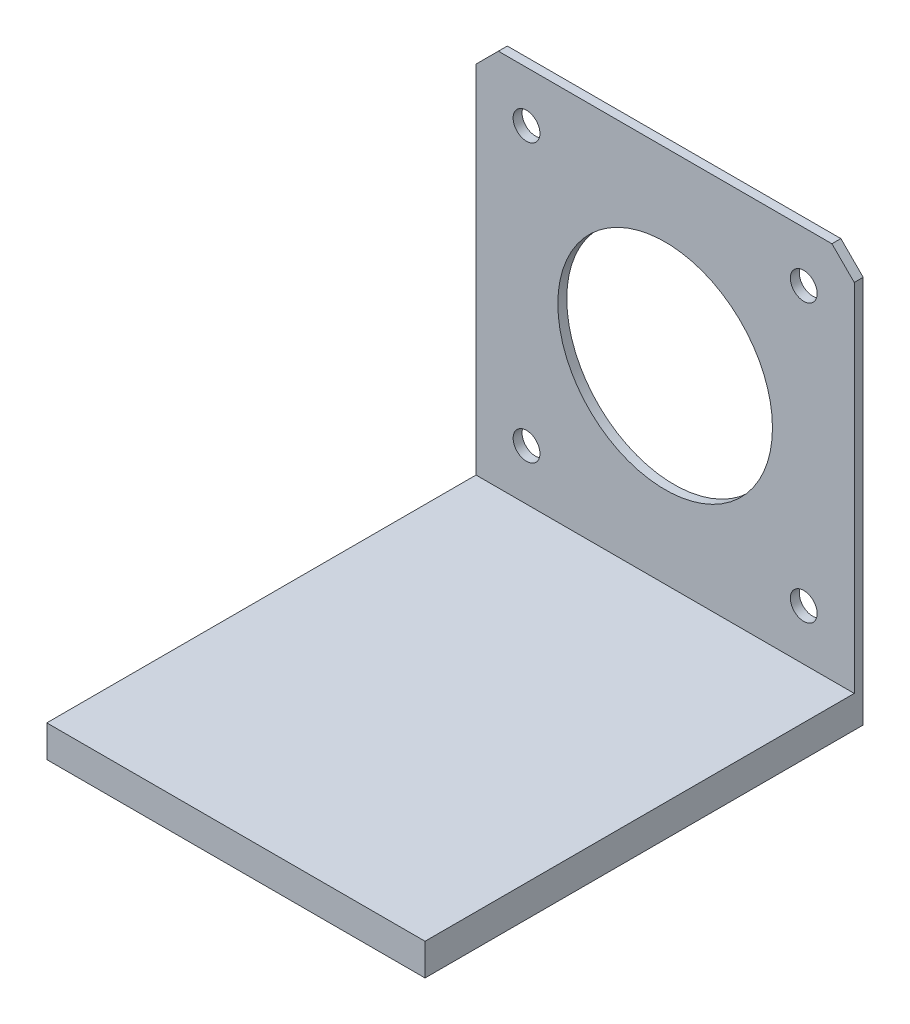
ISO-10303-21;
HEADER;
FILE_DESCRIPTION(('STEP AP214'),'2;1');
FILE_NAME('part.step','',(''),(''),'','','');
FILE_SCHEMA(('AUTOMOTIVE_DESIGN { 1 0 10303 214 1 1 1 1 }'));
ENDSEC;
DATA;
#1=APPLICATION_CONTEXT('core data for automotive mechanical design processes');
#2=APPLICATION_PROTOCOL_DEFINITION('international standard','automotive_design',2000,#1);
#3=PRODUCT_CONTEXT('',#1,'mechanical');
#4=PRODUCT('Part','Part','',(#3));
#5=PRODUCT_RELATED_PRODUCT_CATEGORY('part','',(#4));
#6=PRODUCT_DEFINITION_FORMATION('','',#4);
#7=PRODUCT_DEFINITION_CONTEXT('part definition',#1,'design');
#8=PRODUCT_DEFINITION('design','',#6,#7);
#9=PRODUCT_DEFINITION_SHAPE('','',#8);
#10=(LENGTH_UNIT() NAMED_UNIT(*) SI_UNIT(.MILLI.,.METRE.));
#11=(NAMED_UNIT(*) PLANE_ANGLE_UNIT() SI_UNIT($,.RADIAN.));
#12=(NAMED_UNIT(*) SI_UNIT($,.STERADIAN.) SOLID_ANGLE_UNIT());
#13=UNCERTAINTY_MEASURE_WITH_UNIT(LENGTH_MEASURE(1.E-05),#10,'distance_accuracy_value','');
#14=(GEOMETRIC_REPRESENTATION_CONTEXT(3) GLOBAL_UNCERTAINTY_ASSIGNED_CONTEXT((#13)) GLOBAL_UNIT_ASSIGNED_CONTEXT((#10,
#11,#12)) REPRESENTATION_CONTEXT('',''));
#15=CARTESIAN_POINT('',(0.,0.,0.));
#16=DIRECTION('',(0.,0.,1.));
#17=DIRECTION('',(1.,0.,0.));
#18=AXIS2_PLACEMENT_3D('',#15,#16,#17);
#19=CARTESIAN_POINT('',(15.485498489426,0.,0.));
#20=DIRECTION('',(1.,0.,0.));
#21=DIRECTION('',(0.,0.,-1.));
#22=AXIS2_PLACEMENT_3D('',#19,#20,#21);
#23=PLANE('',#22);
#24=DIRECTION('',(0.,0.,-1.));
#25=VECTOR('',#24,1.);
#26=CARTESIAN_POINT('',(15.485498489426,-28.0326586102719,49.));
#27=LINE('',#26,#25);
#28=CARTESIAN_POINT('',(15.485498489426,-28.0326586102719,21.));
#29=VERTEX_POINT('',#28);
#30=CARTESIAN_POINT('',(15.485498489426,-28.0326586102719,1.));
#31=VERTEX_POINT('',#30);
#32=EDGE_CURVE('E512',#29,#31,#27,.T.);
#33=ORIENTED_EDGE('',*,*,#32,.F.);
#34=DIRECTION('',(0.,-1.,0.));
#35=VECTOR('',#34,1.);
#36=CARTESIAN_POINT('',(15.485498489426,-25.4726586102719,21.));
#37=LINE('',#36,#35);
#38=CARTESIAN_POINT('',(15.485498489426,-25.4726586102719,21.));
#39=VERTEX_POINT('',#38);
#40=EDGE_CURVE('E469',#39,#29,#37,.T.);
#41=ORIENTED_EDGE('',*,*,#40,.F.);
#42=DIRECTION('',(0.,0.,-1.));
#43=VECTOR('',#42,1.);
#44=CARTESIAN_POINT('',(15.485498489426,-25.4726586102719,49.));
#45=LINE('',#44,#43);
#46=CARTESIAN_POINT('',(15.485498489426,-25.4726586102719,1.));
#47=VERTEX_POINT('',#46);
#48=EDGE_CURVE('E217',#39,#47,#45,.T.);
#49=ORIENTED_EDGE('',*,*,#48,.T.);
#50=DIRECTION('',(0.,1.,0.));
#51=VECTOR('',#50,1.);
#52=CARTESIAN_POINT('',(15.485498489426,0.,1.));
#53=LINE('',#52,#51);
#54=EDGE_CURVE('E216',#31,#47,#53,.T.);
#55=ORIENTED_EDGE('',*,*,#54,.F.);
#56=EDGE_LOOP('',(#33,#41,#49,#55));
#57=FACE_BOUND('',#56,.T.);
#58=ADVANCED_FACE('F47',(#57),#23,.F.);
#59=CARTESIAN_POINT('',(-25.814501510574,-25.4726586102719,49.));
#60=DIRECTION('',(0.,1.,0.));
#61=DIRECTION('',(0.,0.,1.));
#62=AXIS2_PLACEMENT_3D('',#59,#60,#61);
#63=PLANE('',#62);
#64=ORIENTED_EDGE('',*,*,#48,.F.);
#65=DIRECTION('',(1.,0.,0.));
#66=VECTOR('',#65,1.);
#67=CARTESIAN_POINT('',(15.485498489426,-25.4726586102719,21.));
#68=LINE('',#67,#66);
#69=CARTESIAN_POINT('',(9.48549848942598,-25.4726586102719,21.));
#70=VERTEX_POINT('',#69);
#71=EDGE_CURVE('E199',#70,#39,#68,.T.);
#72=ORIENTED_EDGE('',*,*,#71,.F.);
#73=DIRECTION('',(0.,0.,-1.));
#74=VECTOR('',#73,1.);
#75=CARTESIAN_POINT('',(9.48549848942598,-25.4726586102719,28.));
#76=LINE('',#75,#74);
#77=CARTESIAN_POINT('',(9.48549848942598,-25.4726586102719,28.));
#78=VERTEX_POINT('',#77);
#79=EDGE_CURVE('E210',#78,#70,#76,.T.);
#80=ORIENTED_EDGE('',*,*,#79,.F.);
#81=DIRECTION('',(-1.,0.,0.));
#82=VECTOR('',#81,1.);
#83=CARTESIAN_POINT('',(15.485498489426,-25.4726586102719,28.));
#84=LINE('',#83,#82);
#85=CARTESIAN_POINT('',(15.485498489426,-25.4726586102719,28.));
#86=VERTEX_POINT('',#85);
#87=EDGE_CURVE('E190',#86,#78,#84,.T.);
#88=ORIENTED_EDGE('',*,*,#87,.F.);
#89=CARTESIAN_POINT('',(15.485498489426,-25.4726586102719,48.));
#90=VERTEX_POINT('',#89);
#91=EDGE_CURVE('E206',#90,#86,#45,.T.);
#92=ORIENTED_EDGE('',*,*,#91,.F.);
#93=DIRECTION('',(1.,0.,0.));
#94=VECTOR('',#93,1.);
#95=CARTESIAN_POINT('',(-25.814501510574,-25.4726586102719,48.));
#96=LINE('',#95,#94);
#97=CARTESIAN_POINT('',(-24.814501510574,-25.4726586102719,48.));
#98=VERTEX_POINT('',#97);
#99=EDGE_CURVE('E244',#98,#90,#96,.T.);
#100=ORIENTED_EDGE('',*,*,#99,.F.);
#101=DIRECTION('',(0.,0.,-1.));
#102=VECTOR('',#101,1.);
#103=CARTESIAN_POINT('',(-24.814501510574,-25.4726586102719,49.));
#104=LINE('',#103,#102);
#105=CARTESIAN_POINT('',(-24.814501510574,-25.4726586102719,28.));
#106=VERTEX_POINT('',#105);
#107=EDGE_CURVE('E236',#98,#106,#104,.T.);
#108=ORIENTED_EDGE('',*,*,#107,.T.);
#109=DIRECTION('',(-1.,0.,0.));
#110=VECTOR('',#109,1.);
#111=CARTESIAN_POINT('',(-24.814501510574,-25.4726586102719,28.));
#112=LINE('',#111,#110);
#113=CARTESIAN_POINT('',(-18.814501510574,-25.4726586102719,28.));
#114=VERTEX_POINT('',#113);
#115=EDGE_CURVE('E488',#114,#106,#112,.T.);
#116=ORIENTED_EDGE('',*,*,#115,.F.);
#117=DIRECTION('',(0.,0.,1.));
#118=VECTOR('',#117,1.);
#119=CARTESIAN_POINT('',(-18.814501510574,-25.4726586102719,28.));
#120=LINE('',#119,#118);
#121=CARTESIAN_POINT('',(-18.814501510574,-25.4726586102719,21.));
#122=VERTEX_POINT('',#121);
#123=EDGE_CURVE('E496',#122,#114,#120,.T.);
#124=ORIENTED_EDGE('',*,*,#123,.F.);
#125=DIRECTION('',(1.,0.,0.));
#126=VECTOR('',#125,1.);
#127=CARTESIAN_POINT('',(-24.814501510574,-25.4726586102719,21.));
#128=LINE('',#127,#126);
#129=CARTESIAN_POINT('',(-24.814501510574,-25.4726586102719,21.));
#130=VERTEX_POINT('',#129);
#131=EDGE_CURVE('E479',#130,#122,#128,.T.);
#132=ORIENTED_EDGE('',*,*,#131,.F.);
#133=CARTESIAN_POINT('',(-24.814501510574,-25.4726586102719,1.));
#134=VERTEX_POINT('',#133);
#135=EDGE_CURVE('E235',#130,#134,#104,.T.);
#136=ORIENTED_EDGE('',*,*,#135,.T.);
#137=DIRECTION('',(1.,0.,0.));
#138=VECTOR('',#137,1.);
#139=CARTESIAN_POINT('',(-25.814501510574,-25.4726586102719,1.));
#140=LINE('',#139,#138);
#141=EDGE_CURVE('E252',#134,#47,#140,.T.);
#142=ORIENTED_EDGE('',*,*,#141,.T.);
#143=EDGE_LOOP('',(#64,#72,#80,#88,#92,#100,#108,#116,#124,#132,#136,#142));
#144=FACE_BOUND('',#143,.T.);
#145=ADVANCED_FACE('F204',(#144),#63,.F.);
#146=CARTESIAN_POINT('',(-24.814501510574,0.,0.));
#147=DIRECTION('',(1.,0.,0.));
#148=DIRECTION('',(0.,0.,-1.));
#149=AXIS2_PLACEMENT_3D('',#146,#147,#148);
#150=PLANE('',#149);
#151=ORIENTED_EDGE('',*,*,#135,.F.);
#152=DIRECTION('',(0.,1.,0.));
#153=VECTOR('',#152,1.);
#154=CARTESIAN_POINT('',(-24.814501510574,-28.0326586102719,21.));
#155=LINE('',#154,#153);
#156=CARTESIAN_POINT('',(-24.814501510574,-28.0326586102719,21.));
#157=VERTEX_POINT('',#156);
#158=EDGE_CURVE('E510',#157,#130,#155,.T.);
#159=ORIENTED_EDGE('',*,*,#158,.F.);
#160=DIRECTION('',(0.,0.,1.));
#161=VECTOR('',#160,1.);
#162=CARTESIAN_POINT('',(-24.814501510574,-28.0326586102719,0.));
#163=LINE('',#162,#161);
#164=CARTESIAN_POINT('',(-24.814501510574,-28.0326586102719,1.));
#165=VERTEX_POINT('',#164);
#166=EDGE_CURVE('E228',#165,#157,#163,.T.);
#167=ORIENTED_EDGE('',*,*,#166,.F.);
#168=DIRECTION('',(0.,1.,0.));
#169=VECTOR('',#168,1.);
#170=CARTESIAN_POINT('',(-24.814501510574,0.,1.));
#171=LINE('',#170,#169);
#172=EDGE_CURVE('E240',#165,#134,#171,.T.);
#173=ORIENTED_EDGE('',*,*,#172,.T.);
#174=EDGE_LOOP('',(#151,#159,#167,#173));
#175=FACE_BOUND('',#174,.T.);
#176=ADVANCED_FACE('F436',(#175),#150,.T.);
#177=CARTESIAN_POINT('',(-24.814501510574,-28.0326586102719,28.));
#178=VERTEX_POINT('',#177);
#179=CARTESIAN_POINT('',(-24.814501510574,-28.0326586102719,48.));
#180=VERTEX_POINT('',#179);
#181=EDGE_CURVE('E222',#178,#180,#163,.T.);
#182=ORIENTED_EDGE('',*,*,#181,.F.);
#183=DIRECTION('',(0.,1.,0.));
#184=VECTOR('',#183,1.);
#185=CARTESIAN_POINT('',(-24.814501510574,-28.0326586102719,28.));
#186=LINE('',#185,#184);
#187=EDGE_CURVE('E72',#178,#106,#186,.T.);
#188=ORIENTED_EDGE('',*,*,#187,.T.);
#189=ORIENTED_EDGE('',*,*,#107,.F.);
#190=DIRECTION('',(0.,1.,0.));
#191=VECTOR('',#190,1.);
#192=CARTESIAN_POINT('',(-24.814501510574,-28.0326586102719,48.));
#193=LINE('',#192,#191);
#194=EDGE_CURVE('E232',#180,#98,#193,.T.);
#195=ORIENTED_EDGE('',*,*,#194,.F.);
#196=EDGE_LOOP('',(#182,#188,#189,#195));
#197=FACE_BOUND('',#196,.T.);
#198=ADVANCED_FACE('F526',(#197),#150,.T.);
#199=CARTESIAN_POINT('',(16.485498489426,17.8273413897281,1.));
#200=DIRECTION('',(-1.,0.,0.));
#201=DIRECTION('',(0.,-1.,0.));
#202=AXIS2_PLACEMENT_3D('',#199,#200,#201);
#203=PLANE('',#202);
#204=DIRECTION('',(0.,1.,0.));
#205=VECTOR('',#204,1.);
#206=CARTESIAN_POINT('',(16.485498489426,17.8273413897281,1.));
#207=LINE('',#206,#205);
#208=CARTESIAN_POINT('',(16.485498489426,-24.4726586102719,1.));
#209=VERTEX_POINT('',#208);
#210=CARTESIAN_POINT('',(16.485498489426,15.3273413897281,1.));
#211=VERTEX_POINT('',#210);
#212=EDGE_CURVE('E335',#209,#211,#207,.T.);
#213=ORIENTED_EDGE('',*,*,#212,.F.);
#214=DIRECTION('',(0.,0.,-1.));
#215=VECTOR('',#214,1.);
#216=CARTESIAN_POINT('',(16.485498489426,-24.4726586102719,49.));
#217=LINE('',#216,#215);
#218=CARTESIAN_POINT('',(16.485498489426,-24.4726586102719,49.));
#219=VERTEX_POINT('',#218);
#220=EDGE_CURVE('E275',#219,#209,#217,.T.);
#221=ORIENTED_EDGE('',*,*,#220,.F.);
#222=DIRECTION('',(0.,1.,0.));
#223=VECTOR('',#222,1.);
#224=CARTESIAN_POINT('',(16.485498489426,-25.4726586102719,49.));
#225=LINE('',#224,#223);
#226=CARTESIAN_POINT('',(16.485498489426,-28.0326586102719,49.));
#227=VERTEX_POINT('',#226);
#228=EDGE_CURVE('E259',#227,#219,#225,.T.);
#229=ORIENTED_EDGE('',*,*,#228,.F.);
#230=DIRECTION('',(0.,0.,1.));
#231=VECTOR('',#230,1.);
#232=CARTESIAN_POINT('',(16.485498489426,-28.0326586102719,1.));
#233=LINE('',#232,#231);
#234=CARTESIAN_POINT('',(16.485498489426,-28.0326586102719,0.));
#235=VERTEX_POINT('',#234);
#236=EDGE_CURVE('E284',#235,#227,#233,.T.);
#237=ORIENTED_EDGE('',*,*,#236,.F.);
#238=DIRECTION('',(0.,1.,0.));
#239=VECTOR('',#238,1.);
#240=CARTESIAN_POINT('',(16.485498489426,17.8273413897281,0.));
#241=LINE('',#240,#239);
#242=CARTESIAN_POINT('',(16.485498489426,15.3273413897281,0.));
#243=VERTEX_POINT('',#242);
#244=EDGE_CURVE('E347',#235,#243,#241,.T.);
#245=ORIENTED_EDGE('',*,*,#244,.T.);
#246=DIRECTION('',(0.,0.,1.));
#247=VECTOR('',#246,1.);
#248=CARTESIAN_POINT('',(16.485498489426,15.3273413897281,1.));
#249=LINE('',#248,#247);
#250=EDGE_CURVE('E369',#243,#211,#249,.T.);
#251=ORIENTED_EDGE('',*,*,#250,.T.);
#252=EDGE_LOOP('',(#213,#221,#229,#237,#245,#251));
#253=FACE_BOUND('',#252,.T.);
#254=ADVANCED_FACE('F408',(#253),#203,.F.);
#255=CARTESIAN_POINT('',(-25.814501510574,17.8273413897281,1.));
#256=DIRECTION('',(1.,0.,0.));
#257=DIRECTION('',(0.,1.,0.));
#258=AXIS2_PLACEMENT_3D('',#255,#256,#257);
#259=PLANE('',#258);
#260=DIRECTION('',(0.,0.,-1.));
#261=VECTOR('',#260,1.);
#262=CARTESIAN_POINT('',(-25.814501510574,-24.4726586102719,49.));
#263=LINE('',#262,#261);
#264=CARTESIAN_POINT('',(-25.814501510574,-24.4726586102719,49.));
#265=VERTEX_POINT('',#264);
#266=CARTESIAN_POINT('',(-25.814501510574,-24.4726586102719,1.));
#267=VERTEX_POINT('',#266);
#268=EDGE_CURVE('E266',#265,#267,#263,.T.);
#269=ORIENTED_EDGE('',*,*,#268,.T.);
#270=DIRECTION('',(0.,-1.,0.));
#271=VECTOR('',#270,1.);
#272=CARTESIAN_POINT('',(-25.814501510574,17.8273413897281,1.));
#273=LINE('',#272,#271);
#274=CARTESIAN_POINT('',(-25.814501510574,15.3273413897281,1.));
#275=VERTEX_POINT('',#274);
#276=EDGE_CURVE('E331',#275,#267,#273,.T.);
#277=ORIENTED_EDGE('',*,*,#276,.F.);
#278=DIRECTION('',(0.,0.,-1.));
#279=VECTOR('',#278,1.);
#280=CARTESIAN_POINT('',(-25.814501510574,15.3273413897281,1.));
#281=LINE('',#280,#279);
#282=CARTESIAN_POINT('',(-25.814501510574,15.3273413897281,0.));
#283=VERTEX_POINT('',#282);
#284=EDGE_CURVE('E359',#275,#283,#281,.T.);
#285=ORIENTED_EDGE('',*,*,#284,.T.);
#286=DIRECTION('',(0.,-1.,0.));
#287=VECTOR('',#286,1.);
#288=CARTESIAN_POINT('',(-25.814501510574,17.8273413897281,0.));
#289=LINE('',#288,#287);
#290=CARTESIAN_POINT('',(-25.814501510574,-28.0326586102719,0.));
#291=VERTEX_POINT('',#290);
#292=EDGE_CURVE('E327',#283,#291,#289,.T.);
#293=ORIENTED_EDGE('',*,*,#292,.T.);
#294=DIRECTION('',(0.,0.,-1.));
#295=VECTOR('',#294,1.);
#296=CARTESIAN_POINT('',(-25.814501510574,-28.0326586102719,1.));
#297=LINE('',#296,#295);
#298=CARTESIAN_POINT('',(-25.814501510574,-28.0326586102719,49.));
#299=VERTEX_POINT('',#298);
#300=EDGE_CURVE('E278',#299,#291,#297,.T.);
#301=ORIENTED_EDGE('',*,*,#300,.F.);
#302=DIRECTION('',(0.,-1.,0.));
#303=VECTOR('',#302,1.);
#304=CARTESIAN_POINT('',(-25.814501510574,-25.4726586102719,49.));
#305=LINE('',#304,#303);
#306=EDGE_CURVE('E255',#265,#299,#305,.T.);
#307=ORIENTED_EDGE('',*,*,#306,.F.);
#308=EDGE_LOOP('',(#269,#277,#285,#293,#301,#307));
#309=FACE_BOUND('',#308,.T.);
#310=ADVANCED_FACE('F397',(#309),#259,.F.);
#311=CARTESIAN_POINT('',(0.,0.,1.));
#312=DIRECTION('',(0.,0.,1.));
#313=DIRECTION('',(1.,0.,0.));
#314=AXIS2_PLACEMENT_3D('',#311,#312,#313);
#315=PLANE('',#314);
#316=DIRECTION('',(-1.,0.,0.));
#317=VECTOR('',#316,1.);
#318=CARTESIAN_POINT('',(-25.814501510574,-28.0326586102719,1.));
#319=LINE('',#318,#317);
#320=EDGE_CURVE('E287',#31,#165,#319,.T.);
#321=ORIENTED_EDGE('',*,*,#320,.F.);
#322=ORIENTED_EDGE('',*,*,#54,.T.);
#323=ORIENTED_EDGE('',*,*,#141,.F.);
#324=ORIENTED_EDGE('',*,*,#172,.F.);
#325=EDGE_LOOP('',(#321,#322,#323,#324));
#326=FACE_BOUND('',#325,.T.);
#327=ADVANCED_FACE('F536',(#326),#315,.T.);
#328=CARTESIAN_POINT('',(-25.814501510574,-28.0326586102719,48.));
#329=DIRECTION('',(0.,0.,1.));
#330=DIRECTION('',(1.,0.,0.));
#331=AXIS2_PLACEMENT_3D('',#328,#329,#330);
#332=PLANE('',#331);
#333=DIRECTION('',(0.,1.,0.));
#334=VECTOR('',#333,1.);
#335=CARTESIAN_POINT('',(15.485498489426,-28.0326586102719,48.));
#336=LINE('',#335,#334);
#337=CARTESIAN_POINT('',(15.485498489426,-28.0326586102719,48.));
#338=VERTEX_POINT('',#337);
#339=EDGE_CURVE('E11',#338,#90,#336,.T.);
#340=ORIENTED_EDGE('',*,*,#339,.F.);
#341=DIRECTION('',(1.,0.,0.));
#342=VECTOR('',#341,1.);
#343=CARTESIAN_POINT('',(-25.814501510574,-28.0326586102719,48.));
#344=LINE('',#343,#342);
#345=EDGE_CURVE('E245',#180,#338,#344,.T.);
#346=ORIENTED_EDGE('',*,*,#345,.F.);
#347=ORIENTED_EDGE('',*,*,#194,.T.);
#348=ORIENTED_EDGE('',*,*,#99,.T.);
#349=EDGE_LOOP('',(#340,#346,#347,#348));
#350=FACE_BOUND('',#349,.T.);
#351=ADVANCED_FACE('F520',(#350),#332,.F.);
#352=DIRECTION('',(-1.,0.,0.));
#353=VECTOR('',#352,1.);
#354=CARTESIAN_POINT('',(-25.814501510574,-24.4726586102719,1.));
#355=LINE('',#354,#353);
#356=EDGE_CURVE('E260',#209,#267,#355,.T.);
#357=ORIENTED_EDGE('',*,*,#356,.F.);
#358=ORIENTED_EDGE('',*,*,#212,.T.);
#359=DIRECTION('',(0.707106781186547,-0.707106781186549,0.));
#360=VECTOR('',#359,1.);
#361=CARTESIAN_POINT('',(15.9064199395771,15.906419939577,1.));
#362=LINE('',#361,#360);
#363=CARTESIAN_POINT('',(13.985498489426,17.8273413897281,1.));
#364=VERTEX_POINT('',#363);
#365=EDGE_CURVE('E366',#211,#364,#362,.F.);
#366=ORIENTED_EDGE('',*,*,#365,.T.);
#367=DIRECTION('',(-1.,0.,0.));
#368=VECTOR('',#367,1.);
#369=CARTESIAN_POINT('',(-25.814501510574,17.8273413897281,1.));
#370=LINE('',#369,#368);
#371=CARTESIAN_POINT('',(-23.314501510574,17.8273413897281,1.));
#372=VERTEX_POINT('',#371);
#373=EDGE_CURVE('E339',#364,#372,#370,.T.);
#374=ORIENTED_EDGE('',*,*,#373,.T.);
#375=DIRECTION('',(0.707106781186549,0.707106781186547,0.));
#376=VECTOR('',#375,1.);
#377=CARTESIAN_POINT('',(-20.570921450151,20.5709214501511,1.));
#378=LINE('',#377,#376);
#379=EDGE_CURVE('E363',#372,#275,#378,.F.);
#380=ORIENTED_EDGE('',*,*,#379,.T.);
#381=ORIENTED_EDGE('',*,*,#276,.T.);
#382=EDGE_LOOP('',(#357,#358,#366,#374,#380,#381));
#383=FACE_BOUND('',#382,.T.);
#384=CARTESIAN_POINT('',(10.835498489426,12.1773413897281,1.));
#385=DIRECTION('',(0.,0.,1.));
#386=DIRECTION('',(1.,0.,0.));
#387=AXIS2_PLACEMENT_3D('',#384,#385,#386);
#388=CIRCLE('',#387,1.5);
#389=CARTESIAN_POINT('',(12.335498489426,12.1773413897281,1.));
#390=VERTEX_POINT('',#389);
#391=EDGE_CURVE('E308',#390,#390,#388,.T.);
#392=ORIENTED_EDGE('',*,*,#391,.F.);
#393=EDGE_LOOP('',(#392));
#394=FACE_BOUND('',#393,.T.);
#395=CARTESIAN_POINT('',(10.835498489426,-18.8226586102719,1.));
#396=DIRECTION('',(0.,0.,1.));
#397=DIRECTION('',(1.,0.,0.));
#398=AXIS2_PLACEMENT_3D('',#395,#396,#397);
#399=CIRCLE('',#398,1.5);
#400=CARTESIAN_POINT('',(12.335498489426,-18.8226586102719,1.));
#401=VERTEX_POINT('',#400);
#402=EDGE_CURVE('E300',#401,#401,#399,.T.);
#403=ORIENTED_EDGE('',*,*,#402,.F.);
#404=EDGE_LOOP('',(#403));
#405=FACE_BOUND('',#404,.T.);
#406=CARTESIAN_POINT('',(-20.164501510574,-18.8226586102719,1.));
#407=DIRECTION('',(0.,0.,1.));
#408=DIRECTION('',(1.,0.,0.));
#409=AXIS2_PLACEMENT_3D('',#406,#407,#408);
#410=CIRCLE('',#409,1.5);
#411=CARTESIAN_POINT('',(-18.664501510574,-18.8226586102719,1.));
#412=VERTEX_POINT('',#411);
#413=EDGE_CURVE('E291',#412,#412,#410,.T.);
#414=ORIENTED_EDGE('',*,*,#413,.F.);
#415=EDGE_LOOP('',(#414));
#416=FACE_BOUND('',#415,.T.);
#417=CARTESIAN_POINT('',(-20.164501510574,12.1773413897281,1.));
#418=DIRECTION('',(0.,0.,1.));
#419=DIRECTION('',(1.,0.,0.));
#420=AXIS2_PLACEMENT_3D('',#417,#418,#419);
#421=CIRCLE('',#420,1.5);
#422=CARTESIAN_POINT('',(-18.664501510574,12.1773413897281,1.));
#423=VERTEX_POINT('',#422);
#424=EDGE_CURVE('E295',#423,#423,#421,.T.);
#425=ORIENTED_EDGE('',*,*,#424,.F.);
#426=EDGE_LOOP('',(#425));
#427=FACE_BOUND('',#426,.T.);
#428=CARTESIAN_POINT('',(-4.66450151057403,-3.32265861027189,1.));
#429=DIRECTION('',(0.,0.,1.));
#430=DIRECTION('',(1.,0.,0.));
#431=AXIS2_PLACEMENT_3D('',#428,#429,#430);
#432=CIRCLE('',#431,12.);
#433=CARTESIAN_POINT('',(7.33549848942598,-3.32265861027189,1.));
#434=VERTEX_POINT('',#433);
#435=EDGE_CURVE('E319',#434,#434,#432,.T.);
#436=ORIENTED_EDGE('',*,*,#435,.F.);
#437=EDGE_LOOP('',(#436));
#438=FACE_BOUND('',#437,.T.);
#439=ADVANCED_FACE('F403',(#383,#394,#405,#416,#427,#438),#315,.T.);
#440=CARTESIAN_POINT('',(-25.814501510574,17.8273413897281,1.));
#441=DIRECTION('',(0.,-1.,0.));
#442=DIRECTION('',(0.,0.,-1.));
#443=AXIS2_PLACEMENT_3D('',#440,#441,#442);
#444=PLANE('',#443);
#445=ORIENTED_EDGE('',*,*,#373,.F.);
#446=DIRECTION('',(0.,0.,-1.));
#447=VECTOR('',#446,1.);
#448=CARTESIAN_POINT('',(13.985498489426,17.8273413897281,1.));
#449=LINE('',#448,#447);
#450=CARTESIAN_POINT('',(13.985498489426,17.8273413897281,0.));
#451=VERTEX_POINT('',#450);
#452=EDGE_CURVE('E57',#364,#451,#449,.T.);
#453=ORIENTED_EDGE('',*,*,#452,.T.);
#454=DIRECTION('',(-1.,0.,0.));
#455=VECTOR('',#454,1.);
#456=CARTESIAN_POINT('',(-25.814501510574,17.8273413897281,0.));
#457=LINE('',#456,#455);
#458=CARTESIAN_POINT('',(-23.314501510574,17.8273413897281,0.));
#459=VERTEX_POINT('',#458);
#460=EDGE_CURVE('E336',#451,#459,#457,.T.);
#461=ORIENTED_EDGE('',*,*,#460,.T.);
#462=DIRECTION('',(0.,0.,1.));
#463=VECTOR('',#462,1.);
#464=CARTESIAN_POINT('',(-23.314501510574,17.8273413897281,1.));
#465=LINE('',#464,#463);
#466=EDGE_CURVE('E373',#459,#372,#465,.T.);
#467=ORIENTED_EDGE('',*,*,#466,.T.);
#468=EDGE_LOOP('',(#445,#453,#461,#467));
#469=FACE_BOUND('',#468,.T.);
#470=ADVANCED_FACE('F381',(#469),#444,.F.);
#471=CARTESIAN_POINT('',(0.,0.,0.));
#472=DIRECTION('',(0.,0.,1.));
#473=DIRECTION('',(1.,0.,0.));
#474=AXIS2_PLACEMENT_3D('',#471,#472,#473);
#475=PLANE('',#474);
#476=DIRECTION('',(-0.707106781186547,0.707106781186549,0.));
#477=VECTOR('',#476,1.);
#478=CARTESIAN_POINT('',(13.985498489426,17.8273413897281,0.));
#479=LINE('',#478,#477);
#480=EDGE_CURVE('E355',#451,#243,#479,.F.);
#481=ORIENTED_EDGE('',*,*,#480,.T.);
#482=ORIENTED_EDGE('',*,*,#244,.F.);
#483=DIRECTION('',(1.,0.,0.));
#484=VECTOR('',#483,1.);
#485=CARTESIAN_POINT('',(-25.814501510574,-28.0326586102719,0.));
#486=LINE('',#485,#484);
#487=EDGE_CURVE('E281',#291,#235,#486,.T.);
#488=ORIENTED_EDGE('',*,*,#487,.F.);
#489=ORIENTED_EDGE('',*,*,#292,.F.);
#490=DIRECTION('',(-0.707106781186549,-0.707106781186547,0.));
#491=VECTOR('',#490,1.);
#492=CARTESIAN_POINT('',(-25.814501510574,15.3273413897281,0.));
#493=LINE('',#492,#491);
#494=EDGE_CURVE('E343',#283,#459,#493,.F.);
#495=ORIENTED_EDGE('',*,*,#494,.T.);
#496=ORIENTED_EDGE('',*,*,#460,.F.);
#497=EDGE_LOOP('',(#481,#482,#488,#489,#495,#496));
#498=FACE_BOUND('',#497,.T.);
#499=CARTESIAN_POINT('',(10.835498489426,12.1773413897281,0.));
#500=DIRECTION('',(0.,0.,1.));
#501=DIRECTION('',(1.,0.,0.));
#502=AXIS2_PLACEMENT_3D('',#499,#500,#501);
#503=CIRCLE('',#502,1.5);
#504=CARTESIAN_POINT('',(12.335498489426,12.1773413897281,0.));
#505=VERTEX_POINT('',#504);
#506=EDGE_CURVE('E290',#505,#505,#503,.T.);
#507=ORIENTED_EDGE('',*,*,#506,.T.);
#508=EDGE_LOOP('',(#507));
#509=FACE_BOUND('',#508,.T.);
#510=CARTESIAN_POINT('',(10.835498489426,-18.8226586102719,0.));
#511=DIRECTION('',(0.,0.,1.));
#512=DIRECTION('',(1.,0.,0.));
#513=AXIS2_PLACEMENT_3D('',#510,#511,#512);
#514=CIRCLE('',#513,1.5);
#515=CARTESIAN_POINT('',(12.335498489426,-18.8226586102719,0.));
#516=VERTEX_POINT('',#515);
#517=EDGE_CURVE('E304',#516,#516,#514,.T.);
#518=ORIENTED_EDGE('',*,*,#517,.T.);
#519=EDGE_LOOP('',(#518));
#520=FACE_BOUND('',#519,.T.);
#521=CARTESIAN_POINT('',(-20.164501510574,-18.8226586102719,0.));
#522=DIRECTION('',(0.,0.,1.));
#523=DIRECTION('',(1.,0.,0.));
#524=AXIS2_PLACEMENT_3D('',#521,#522,#523);
#525=CIRCLE('',#524,1.5);
#526=CARTESIAN_POINT('',(-18.664501510574,-18.8226586102719,0.));
#527=VERTEX_POINT('',#526);
#528=EDGE_CURVE('E296',#527,#527,#525,.T.);
#529=ORIENTED_EDGE('',*,*,#528,.T.);
#530=EDGE_LOOP('',(#529));
#531=FACE_BOUND('',#530,.T.);
#532=CARTESIAN_POINT('',(-20.164501510574,12.1773413897281,0.));
#533=DIRECTION('',(0.,0.,1.));
#534=DIRECTION('',(1.,0.,0.));
#535=AXIS2_PLACEMENT_3D('',#532,#533,#534);
#536=CIRCLE('',#535,1.5);
#537=CARTESIAN_POINT('',(-18.664501510574,12.1773413897281,0.));
#538=VERTEX_POINT('',#537);
#539=EDGE_CURVE('E315',#538,#538,#536,.T.);
#540=ORIENTED_EDGE('',*,*,#539,.T.);
#541=EDGE_LOOP('',(#540));
#542=FACE_BOUND('',#541,.T.);
#543=CARTESIAN_POINT('',(-4.66450151057403,-3.32265861027189,0.));
#544=DIRECTION('',(0.,0.,1.));
#545=DIRECTION('',(1.,0.,0.));
#546=AXIS2_PLACEMENT_3D('',#543,#544,#545);
#547=CIRCLE('',#546,12.);
#548=CARTESIAN_POINT('',(7.33549848942598,-3.32265861027189,0.));
#549=VERTEX_POINT('',#548);
#550=EDGE_CURVE('E323',#549,#549,#547,.T.);
#551=ORIENTED_EDGE('',*,*,#550,.T.);
#552=EDGE_LOOP('',(#551));
#553=FACE_BOUND('',#552,.T.);
#554=ADVANCED_FACE('F386',(#498,#509,#520,#531,#542,#553),#475,.F.);
#555=CARTESIAN_POINT('',(13.985498489426,17.8273413897281,1.));
#556=DIRECTION('',(-0.707106781186549,-0.707106781186547,0.));
#557=DIRECTION('',(0.,0.,-1.));
#558=AXIS2_PLACEMENT_3D('',#555,#556,#557);
#559=PLANE('',#558);
#560=ORIENTED_EDGE('',*,*,#365,.F.);
#561=ORIENTED_EDGE('',*,*,#250,.F.);
#562=ORIENTED_EDGE('',*,*,#480,.F.);
#563=ORIENTED_EDGE('',*,*,#452,.F.);
#564=EDGE_LOOP('',(#560,#561,#562,#563));
#565=FACE_BOUND('',#564,.T.);
#566=ADVANCED_FACE('F406',(#565),#559,.F.);
#567=CARTESIAN_POINT('',(-25.814501510574,15.3273413897281,1.));
#568=DIRECTION('',(0.707106781186546,-0.707106781186548,0.));
#569=DIRECTION('',(0.,0.,-1.));
#570=AXIS2_PLACEMENT_3D('',#567,#568,#569);
#571=PLANE('',#570);
#572=ORIENTED_EDGE('',*,*,#379,.F.);
#573=ORIENTED_EDGE('',*,*,#466,.F.);
#574=ORIENTED_EDGE('',*,*,#494,.F.);
#575=ORIENTED_EDGE('',*,*,#284,.F.);
#576=EDGE_LOOP('',(#572,#573,#574,#575));
#577=FACE_BOUND('',#576,.T.);
#578=ADVANCED_FACE('F50',(#577),#571,.F.);
#579=CARTESIAN_POINT('',(-4.66450151057403,-3.32265861027189,0.));
#580=DIRECTION('',(0.,0.,1.));
#581=DIRECTION('',(1.,0.,0.));
#582=AXIS2_PLACEMENT_3D('',#579,#580,#581);
#583=CYLINDRICAL_SURFACE('',#582,12.);
#584=ORIENTED_EDGE('',*,*,#550,.F.);
#585=EDGE_LOOP('',(#584));
#586=FACE_BOUND('',#585,.T.);
#587=ORIENTED_EDGE('',*,*,#435,.T.);
#588=EDGE_LOOP('',(#587));
#589=FACE_BOUND('',#588,.T.);
#590=ADVANCED_FACE('F558',(#586,#589),#583,.F.);
#591=CARTESIAN_POINT('',(-20.164501510574,12.1773413897281,0.));
#592=DIRECTION('',(0.,0.,1.));
#593=DIRECTION('',(1.,0.,0.));
#594=AXIS2_PLACEMENT_3D('',#591,#592,#593);
#595=CYLINDRICAL_SURFACE('',#594,1.5);
#596=ORIENTED_EDGE('',*,*,#539,.F.);
#597=EDGE_LOOP('',(#596));
#598=FACE_BOUND('',#597,.T.);
#599=ORIENTED_EDGE('',*,*,#424,.T.);
#600=EDGE_LOOP('',(#599));
#601=FACE_BOUND('',#600,.T.);
#602=ADVANCED_FACE('F575',(#598,#601),#595,.F.);
#603=CARTESIAN_POINT('',(-20.164501510574,-18.8226586102719,0.));
#604=DIRECTION('',(0.,0.,1.));
#605=DIRECTION('',(1.,0.,0.));
#606=AXIS2_PLACEMENT_3D('',#603,#604,#605);
#607=CYLINDRICAL_SURFACE('',#606,1.5);
#608=ORIENTED_EDGE('',*,*,#528,.F.);
#609=EDGE_LOOP('',(#608));
#610=FACE_BOUND('',#609,.T.);
#611=ORIENTED_EDGE('',*,*,#413,.T.);
#612=EDGE_LOOP('',(#611));
#613=FACE_BOUND('',#612,.T.);
#614=ADVANCED_FACE('F580',(#610,#613),#607,.F.);
#615=CARTESIAN_POINT('',(10.835498489426,-18.8226586102719,0.));
#616=DIRECTION('',(0.,0.,1.));
#617=DIRECTION('',(1.,0.,0.));
#618=AXIS2_PLACEMENT_3D('',#615,#616,#617);
#619=CYLINDRICAL_SURFACE('',#618,1.5);
#620=ORIENTED_EDGE('',*,*,#517,.F.);
#621=EDGE_LOOP('',(#620));
#622=FACE_BOUND('',#621,.T.);
#623=ORIENTED_EDGE('',*,*,#402,.T.);
#624=EDGE_LOOP('',(#623));
#625=FACE_BOUND('',#624,.T.);
#626=ADVANCED_FACE('F590',(#622,#625),#619,.F.);
#627=CARTESIAN_POINT('',(10.835498489426,12.1773413897281,0.));
#628=DIRECTION('',(0.,0.,1.));
#629=DIRECTION('',(1.,0.,0.));
#630=AXIS2_PLACEMENT_3D('',#627,#628,#629);
#631=CYLINDRICAL_SURFACE('',#630,1.5);
#632=ORIENTED_EDGE('',*,*,#506,.F.);
#633=EDGE_LOOP('',(#632));
#634=FACE_BOUND('',#633,.T.);
#635=ORIENTED_EDGE('',*,*,#391,.T.);
#636=EDGE_LOOP('',(#635));
#637=FACE_BOUND('',#636,.T.);
#638=ADVANCED_FACE('F427',(#634,#637),#631,.F.);
#639=CARTESIAN_POINT('',(0.,-28.0326586102719,0.));
#640=DIRECTION('',(0.,-1.,0.));
#641=DIRECTION('',(0.,0.,-1.));
#642=AXIS2_PLACEMENT_3D('',#639,#640,#641);
#643=PLANE('',#642);
#644=ORIENTED_EDGE('',*,*,#300,.T.);
#645=ORIENTED_EDGE('',*,*,#487,.T.);
#646=ORIENTED_EDGE('',*,*,#236,.T.);
#647=DIRECTION('',(-1.,0.,0.));
#648=VECTOR('',#647,1.);
#649=CARTESIAN_POINT('',(-25.814501510574,-28.0326586102719,49.));
#650=LINE('',#649,#648);
#651=EDGE_CURVE('E249',#227,#299,#650,.T.);
#652=ORIENTED_EDGE('',*,*,#651,.T.);
#653=EDGE_LOOP('',(#644,#645,#646,#652));
#654=FACE_BOUND('',#653,.T.);
#655=CARTESIAN_POINT('',(15.485498489426,-28.0326586102719,28.));
#656=VERTEX_POINT('',#655);
#657=EDGE_CURVE('E224',#338,#656,#27,.T.);
#658=ORIENTED_EDGE('',*,*,#657,.T.);
#659=DIRECTION('',(-1.,0.,0.));
#660=VECTOR('',#659,1.);
#661=CARTESIAN_POINT('',(15.485498489426,-28.0326586102719,28.));
#662=LINE('',#661,#660);
#663=CARTESIAN_POINT('',(9.48549848942598,-28.0326586102719,28.));
#664=VERTEX_POINT('',#663);
#665=EDGE_CURVE('E193',#656,#664,#662,.T.);
#666=ORIENTED_EDGE('',*,*,#665,.T.);
#667=DIRECTION('',(0.,0.,-1.));
#668=VECTOR('',#667,1.);
#669=CARTESIAN_POINT('',(9.48549848942598,-28.0326586102719,28.));
#670=LINE('',#669,#668);
#671=CARTESIAN_POINT('',(9.48549848942598,-28.0326586102719,21.));
#672=VERTEX_POINT('',#671);
#673=EDGE_CURVE('E471',#664,#672,#670,.T.);
#674=ORIENTED_EDGE('',*,*,#673,.T.);
#675=DIRECTION('',(1.,0.,0.));
#676=VECTOR('',#675,1.);
#677=CARTESIAN_POINT('',(15.485498489426,-28.0326586102719,21.));
#678=LINE('',#677,#676);
#679=EDGE_CURVE('E64',#672,#29,#678,.T.);
#680=ORIENTED_EDGE('',*,*,#679,.T.);
#681=ORIENTED_EDGE('',*,*,#32,.T.);
#682=ORIENTED_EDGE('',*,*,#320,.T.);
#683=ORIENTED_EDGE('',*,*,#166,.T.);
#684=DIRECTION('',(1.,0.,0.));
#685=VECTOR('',#684,1.);
#686=CARTESIAN_POINT('',(-24.814501510574,-28.0326586102719,21.));
#687=LINE('',#686,#685);
#688=CARTESIAN_POINT('',(-18.814501510574,-28.0326586102719,21.));
#689=VERTEX_POINT('',#688);
#690=EDGE_CURVE('E484',#157,#689,#687,.T.);
#691=ORIENTED_EDGE('',*,*,#690,.T.);
#692=DIRECTION('',(0.,0.,1.));
#693=VECTOR('',#692,1.);
#694=CARTESIAN_POINT('',(-18.814501510574,-28.0326586102719,28.));
#695=LINE('',#694,#693);
#696=CARTESIAN_POINT('',(-18.814501510574,-28.0326586102719,28.));
#697=VERTEX_POINT('',#696);
#698=EDGE_CURVE('E487',#689,#697,#695,.T.);
#699=ORIENTED_EDGE('',*,*,#698,.T.);
#700=DIRECTION('',(-1.,0.,0.));
#701=VECTOR('',#700,1.);
#702=CARTESIAN_POINT('',(-24.814501510574,-28.0326586102719,28.));
#703=LINE('',#702,#701);
#704=EDGE_CURVE('E491',#697,#178,#703,.T.);
#705=ORIENTED_EDGE('',*,*,#704,.T.);
#706=ORIENTED_EDGE('',*,*,#181,.T.);
#707=ORIENTED_EDGE('',*,*,#345,.T.);
#708=EDGE_LOOP('',(#658,#666,#674,#680,#681,#682,#683,#691,#699,#705,#706,#707));
#709=FACE_BOUND('',#708,.T.);
#710=ADVANCED_FACE('F413',(#654,#709),#643,.T.);
#711=CARTESIAN_POINT('',(-25.814501510574,-24.4726586102719,49.));
#712=DIRECTION('',(0.,-1.,0.));
#713=DIRECTION('',(0.,0.,-1.));
#714=AXIS2_PLACEMENT_3D('',#711,#712,#713);
#715=PLANE('',#714);
#716=ORIENTED_EDGE('',*,*,#356,.T.);
#717=ORIENTED_EDGE('',*,*,#268,.F.);
#718=DIRECTION('',(-1.,0.,0.));
#719=VECTOR('',#718,1.);
#720=CARTESIAN_POINT('',(-25.814501510574,-24.4726586102719,49.));
#721=LINE('',#720,#719);
#722=EDGE_CURVE('E263',#219,#265,#721,.T.);
#723=ORIENTED_EDGE('',*,*,#722,.F.);
#724=ORIENTED_EDGE('',*,*,#220,.T.);
#725=EDGE_LOOP('',(#716,#717,#723,#724));
#726=FACE_BOUND('',#725,.T.);
#727=ADVANCED_FACE('F419',(#726),#715,.F.);
#728=CARTESIAN_POINT('',(0.,0.,49.));
#729=DIRECTION('',(0.,0.,-1.));
#730=DIRECTION('',(-1.,0.,0.));
#731=AXIS2_PLACEMENT_3D('',#728,#729,#730);
#732=PLANE('',#731);
#733=ORIENTED_EDGE('',*,*,#722,.T.);
#734=ORIENTED_EDGE('',*,*,#306,.T.);
#735=ORIENTED_EDGE('',*,*,#651,.F.);
#736=ORIENTED_EDGE('',*,*,#228,.T.);
#737=EDGE_LOOP('',(#733,#734,#735,#736));
#738=FACE_BOUND('',#737,.T.);
#739=ADVANCED_FACE('F416',(#738),#732,.F.);
#740=ORIENTED_EDGE('',*,*,#91,.T.);
#741=DIRECTION('',(0.,-1.,0.));
#742=VECTOR('',#741,1.);
#743=CARTESIAN_POINT('',(15.485498489426,-25.4726586102719,28.));
#744=LINE('',#743,#742);
#745=EDGE_CURVE('E187',#86,#656,#744,.T.);
#746=ORIENTED_EDGE('',*,*,#745,.T.);
#747=ORIENTED_EDGE('',*,*,#657,.F.);
#748=ORIENTED_EDGE('',*,*,#339,.T.);
#749=EDGE_LOOP('',(#740,#746,#747,#748));
#750=FACE_BOUND('',#749,.T.);
#751=ADVANCED_FACE('F213',(#750),#23,.F.);
#752=CARTESIAN_POINT('',(-24.814501510574,-28.0326586102719,21.));
#753=DIRECTION('',(0.,0.,1.));
#754=DIRECTION('',(1.,0.,0.));
#755=AXIS2_PLACEMENT_3D('',#752,#753,#754);
#756=PLANE('',#755);
#757=ORIENTED_EDGE('',*,*,#131,.T.);
#758=DIRECTION('',(0.,1.,0.));
#759=VECTOR('',#758,1.);
#760=CARTESIAN_POINT('',(-18.814501510574,-28.0326586102719,21.));
#761=LINE('',#760,#759);
#762=EDGE_CURVE('E507',#689,#122,#761,.T.);
#763=ORIENTED_EDGE('',*,*,#762,.F.);
#764=ORIENTED_EDGE('',*,*,#690,.F.);
#765=ORIENTED_EDGE('',*,*,#158,.T.);
#766=EDGE_LOOP('',(#757,#763,#764,#765));
#767=FACE_BOUND('',#766,.T.);
#768=ADVANCED_FACE('F441',(#767),#756,.F.);
#769=CARTESIAN_POINT('',(-18.814501510574,-28.0326586102719,28.));
#770=DIRECTION('',(-1.,0.,0.));
#771=DIRECTION('',(0.,0.,1.));
#772=AXIS2_PLACEMENT_3D('',#769,#770,#771);
#773=PLANE('',#772);
#774=ORIENTED_EDGE('',*,*,#123,.T.);
#775=DIRECTION('',(0.,1.,0.));
#776=VECTOR('',#775,1.);
#777=CARTESIAN_POINT('',(-18.814501510574,-28.0326586102719,28.));
#778=LINE('',#777,#776);
#779=EDGE_CURVE('E503',#697,#114,#778,.T.);
#780=ORIENTED_EDGE('',*,*,#779,.F.);
#781=ORIENTED_EDGE('',*,*,#698,.F.);
#782=ORIENTED_EDGE('',*,*,#762,.T.);
#783=EDGE_LOOP('',(#774,#780,#781,#782));
#784=FACE_BOUND('',#783,.T.);
#785=ADVANCED_FACE('F445',(#784),#773,.F.);
#786=CARTESIAN_POINT('',(-24.814501510574,-28.0326586102719,28.));
#787=DIRECTION('',(0.,0.,-1.));
#788=DIRECTION('',(-1.,0.,0.));
#789=AXIS2_PLACEMENT_3D('',#786,#787,#788);
#790=PLANE('',#789);
#791=ORIENTED_EDGE('',*,*,#115,.T.);
#792=ORIENTED_EDGE('',*,*,#187,.F.);
#793=ORIENTED_EDGE('',*,*,#704,.F.);
#794=ORIENTED_EDGE('',*,*,#779,.T.);
#795=EDGE_LOOP('',(#791,#792,#793,#794));
#796=FACE_BOUND('',#795,.T.);
#797=ADVANCED_FACE('F450',(#796),#790,.F.);
#798=CARTESIAN_POINT('',(15.485498489426,-25.4726586102719,21.));
#799=DIRECTION('',(0.,0.,-1.));
#800=DIRECTION('',(-1.,0.,0.));
#801=AXIS2_PLACEMENT_3D('',#798,#799,#800);
#802=PLANE('',#801);
#803=ORIENTED_EDGE('',*,*,#679,.F.);
#804=DIRECTION('',(0.,-1.,0.));
#805=VECTOR('',#804,1.);
#806=CARTESIAN_POINT('',(9.48549848942598,-25.4726586102719,21.));
#807=LINE('',#806,#805);
#808=EDGE_CURVE('E467',#70,#672,#807,.T.);
#809=ORIENTED_EDGE('',*,*,#808,.F.);
#810=ORIENTED_EDGE('',*,*,#71,.T.);
#811=ORIENTED_EDGE('',*,*,#40,.T.);
#812=EDGE_LOOP('',(#803,#809,#810,#811));
#813=FACE_BOUND('',#812,.T.);
#814=ADVANCED_FACE('F456',(#813),#802,.T.);
#815=CARTESIAN_POINT('',(9.48549848942598,-25.4726586102719,28.));
#816=DIRECTION('',(-1.,0.,0.));
#817=DIRECTION('',(0.,0.,1.));
#818=AXIS2_PLACEMENT_3D('',#815,#816,#817);
#819=PLANE('',#818);
#820=ORIENTED_EDGE('',*,*,#673,.F.);
#821=DIRECTION('',(0.,-1.,0.));
#822=VECTOR('',#821,1.);
#823=CARTESIAN_POINT('',(9.48549848942598,-25.4726586102719,28.));
#824=LINE('',#823,#822);
#825=EDGE_CURVE('E198',#78,#664,#824,.T.);
#826=ORIENTED_EDGE('',*,*,#825,.F.);
#827=ORIENTED_EDGE('',*,*,#79,.T.);
#828=ORIENTED_EDGE('',*,*,#808,.T.);
#829=EDGE_LOOP('',(#820,#826,#827,#828));
#830=FACE_BOUND('',#829,.T.);
#831=ADVANCED_FACE('F459',(#830),#819,.T.);
#832=CARTESIAN_POINT('',(15.485498489426,-25.4726586102719,28.));
#833=DIRECTION('',(0.,0.,1.));
#834=DIRECTION('',(1.,0.,0.));
#835=AXIS2_PLACEMENT_3D('',#832,#833,#834);
#836=PLANE('',#835);
#837=ORIENTED_EDGE('',*,*,#665,.F.);
#838=ORIENTED_EDGE('',*,*,#745,.F.);
#839=ORIENTED_EDGE('',*,*,#87,.T.);
#840=ORIENTED_EDGE('',*,*,#825,.T.);
#841=EDGE_LOOP('',(#837,#838,#839,#840));
#842=FACE_BOUND('',#841,.T.);
#843=ADVANCED_FACE('F189',(#842),#836,.T.);
#844=CLOSED_SHELL('',(#58,#145,#176,#198,#254,#310,#327,#351,#439,#470,#554,#566,#578,#590,#602,
#614,#626,#638,#710,#727,#739,#751,#768,#785,#797,#814,#831,#843));
#845=MANIFOLD_SOLID_BREP('B2',#844);
#846=ADVANCED_BREP_SHAPE_REPRESENTATION('',(#18,#845),#14);
#847=SHAPE_DEFINITION_REPRESENTATION(#9,#846);
ENDSEC;
END-ISO-10303-21;
